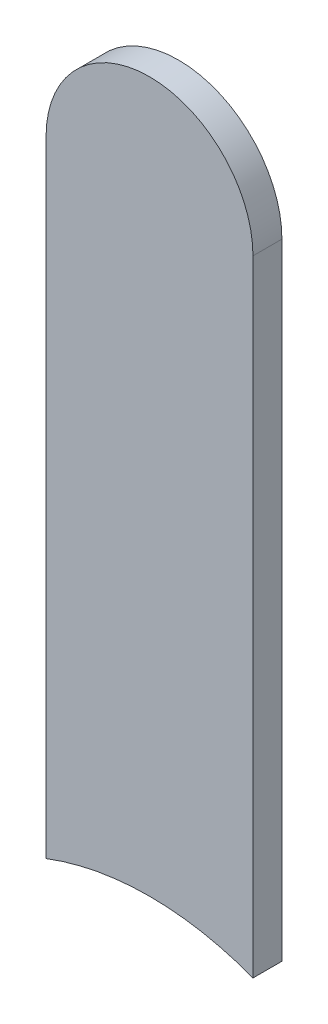
ISO-10303-21;
HEADER;
FILE_DESCRIPTION(('STEP AP214'),'2;1');
FILE_NAME('part.step','',(''),(''),'','','');
FILE_SCHEMA(('AUTOMOTIVE_DESIGN { 1 0 10303 214 1 1 1 1 }'));
ENDSEC;
DATA;
#1=APPLICATION_CONTEXT('core data for automotive mechanical design processes');
#2=APPLICATION_PROTOCOL_DEFINITION('international standard','automotive_design',2000,#1);
#3=PRODUCT_CONTEXT('',#1,'mechanical');
#4=PRODUCT('Part','Part','',(#3));
#5=PRODUCT_RELATED_PRODUCT_CATEGORY('part','',(#4));
#6=PRODUCT_DEFINITION_FORMATION('','',#4);
#7=PRODUCT_DEFINITION_CONTEXT('part definition',#1,'design');
#8=PRODUCT_DEFINITION('design','',#6,#7);
#9=PRODUCT_DEFINITION_SHAPE('','',#8);
#10=(LENGTH_UNIT() NAMED_UNIT(*) SI_UNIT(.MILLI.,.METRE.));
#11=(NAMED_UNIT(*) PLANE_ANGLE_UNIT() SI_UNIT($,.RADIAN.));
#12=(NAMED_UNIT(*) SI_UNIT($,.STERADIAN.) SOLID_ANGLE_UNIT());
#13=UNCERTAINTY_MEASURE_WITH_UNIT(LENGTH_MEASURE(1.E-05),#10,'distance_accuracy_value','');
#14=(GEOMETRIC_REPRESENTATION_CONTEXT(3) GLOBAL_UNCERTAINTY_ASSIGNED_CONTEXT((#13)) GLOBAL_UNIT_ASSIGNED_CONTEXT((#10,
#11,#12)) REPRESENTATION_CONTEXT('',''));
#15=CARTESIAN_POINT('',(0.,0.,0.));
#16=DIRECTION('',(0.,0.,1.));
#17=DIRECTION('',(1.,0.,0.));
#18=AXIS2_PLACEMENT_3D('',#15,#16,#17);
#19=CARTESIAN_POINT('',(92.8439723,93.0191204594978,0.));
#20=DIRECTION('',(-1.,0.,0.));
#21=DIRECTION('',(0.,1.,0.));
#22=AXIS2_PLACEMENT_3D('',#19,#20,#21);
#23=PLANE('',#22);
#24=DIRECTION('',(0.,1.,0.));
#25=VECTOR('',#24,1.);
#26=CARTESIAN_POINT('',(92.8439723,92.68697236,0.03556));
#27=LINE('',#26,#25);
#28=CARTESIAN_POINT('',(92.8439723,93.0191204594978,0.03556));
#29=VERTEX_POINT('',#28);
#30=CARTESIAN_POINT('',(92.8439723,93.7869727,0.03556));
#31=VERTEX_POINT('',#30);
#32=EDGE_CURVE('E11',#29,#31,#27,.T.);
#33=ORIENTED_EDGE('',*,*,#32,.F.);
#34=DIRECTION('',(0.,0.,1.));
#35=VECTOR('',#34,1.);
#36=CARTESIAN_POINT('',(92.8439723,93.0191204594978,0.));
#37=LINE('',#36,#35);
#38=CARTESIAN_POINT('',(92.8439723,93.0191204594978,0.));
#39=VERTEX_POINT('',#38);
#40=EDGE_CURVE('E24',#39,#29,#37,.T.);
#41=ORIENTED_EDGE('',*,*,#40,.F.);
#42=DIRECTION('',(0.,1.,0.));
#43=VECTOR('',#42,1.);
#44=CARTESIAN_POINT('',(92.8439723,92.68697236,0.));
#45=LINE('',#44,#43);
#46=CARTESIAN_POINT('',(92.8439723,93.7869727,0.));
#47=VERTEX_POINT('',#46);
#48=EDGE_CURVE('E75',#39,#47,#45,.T.);
#49=ORIENTED_EDGE('',*,*,#48,.T.);
#50=DIRECTION('',(0.,0.,1.));
#51=VECTOR('',#50,1.);
#52=CARTESIAN_POINT('',(92.8439723,93.7869727,0.));
#53=LINE('',#52,#51);
#54=EDGE_CURVE('E37',#47,#31,#53,.T.);
#55=ORIENTED_EDGE('',*,*,#54,.T.);
#56=EDGE_LOOP('',(#33,#41,#49,#55));
#57=FACE_BOUND('',#56,.T.);
#58=ADVANCED_FACE('F17',(#57),#23,.F.);
#59=CARTESIAN_POINT('',(92.7169723,93.7869727,0.));
#60=DIRECTION('',(0.,0.,-1.));
#61=DIRECTION('',(1.,-1.11896493820492E-13,0.));
#62=AXIS2_PLACEMENT_3D('',#59,#60,#61);
#63=CYLINDRICAL_SURFACE('',#62,0.127);
#64=CARTESIAN_POINT('',(92.7169723,93.7869727,0.03556));
#65=DIRECTION('',(0.,0.,1.));
#66=DIRECTION('',(1.,-1.11896493820492E-13,0.));
#67=AXIS2_PLACEMENT_3D('',#64,#65,#66);
#68=CIRCLE('',#67,0.127);
#69=CARTESIAN_POINT('',(92.5899723,93.7869727,0.03556));
#70=VERTEX_POINT('',#69);
#71=EDGE_CURVE('E83',#31,#70,#68,.T.);
#72=ORIENTED_EDGE('',*,*,#71,.F.);
#73=ORIENTED_EDGE('',*,*,#54,.F.);
#74=CARTESIAN_POINT('',(92.7169723,93.7869727,0.));
#75=DIRECTION('',(0.,0.,1.));
#76=DIRECTION('',(1.,-1.11896493820492E-13,0.));
#77=AXIS2_PLACEMENT_3D('',#74,#75,#76);
#78=CIRCLE('',#77,0.127);
#79=CARTESIAN_POINT('',(92.5899723,93.7869727,0.));
#80=VERTEX_POINT('',#79);
#81=EDGE_CURVE('E81',#47,#80,#78,.T.);
#82=ORIENTED_EDGE('',*,*,#81,.T.);
#83=DIRECTION('',(0.,0.,1.));
#84=VECTOR('',#83,1.);
#85=CARTESIAN_POINT('',(92.5899723,93.7869727,0.));
#86=LINE('',#85,#84);
#87=EDGE_CURVE('E67',#80,#70,#86,.T.);
#88=ORIENTED_EDGE('',*,*,#87,.T.);
#89=EDGE_LOOP('',(#72,#73,#82,#88));
#90=FACE_BOUND('',#89,.T.);
#91=ADVANCED_FACE('F89',(#90),#63,.T.);
#92=CARTESIAN_POINT('',(92.5899723,93.7869727,0.));
#93=DIRECTION('',(1.,0.,0.));
#94=DIRECTION('',(0.,-1.,0.));
#95=AXIS2_PLACEMENT_3D('',#92,#93,#94);
#96=PLANE('',#95);
#97=DIRECTION('',(0.,-1.,0.));
#98=VECTOR('',#97,1.);
#99=CARTESIAN_POINT('',(92.5899723,93.7869727,0.03556));
#100=LINE('',#99,#98);
#101=CARTESIAN_POINT('',(92.5899723,93.0191204594978,0.03556));
#102=VERTEX_POINT('',#101);
#103=EDGE_CURVE('E71',#70,#102,#100,.T.);
#104=ORIENTED_EDGE('',*,*,#103,.F.);
#105=ORIENTED_EDGE('',*,*,#87,.F.);
#106=DIRECTION('',(0.,-1.,0.));
#107=VECTOR('',#106,1.);
#108=CARTESIAN_POINT('',(92.5899723,93.7869727,0.));
#109=LINE('',#108,#107);
#110=CARTESIAN_POINT('',(92.5899723,93.0191204594978,0.));
#111=VERTEX_POINT('',#110);
#112=EDGE_CURVE('E63',#80,#111,#109,.T.);
#113=ORIENTED_EDGE('',*,*,#112,.T.);
#114=DIRECTION('',(0.,0.,1.));
#115=VECTOR('',#114,1.);
#116=CARTESIAN_POINT('',(92.5899723,93.0191204594978,0.));
#117=LINE('',#116,#115);
#118=EDGE_CURVE('E53',#111,#102,#117,.T.);
#119=ORIENTED_EDGE('',*,*,#118,.T.);
#120=EDGE_LOOP('',(#104,#105,#113,#119));
#121=FACE_BOUND('',#120,.T.);
#122=ADVANCED_FACE('F66',(#121),#96,.F.);
#123=CARTESIAN_POINT('',(92.7169723,92.68697236,0.));
#124=DIRECTION('',(0.,0.,-1.));
#125=DIRECTION('',(1.,0.,0.));
#126=AXIS2_PLACEMENT_3D('',#123,#124,#125);
#127=CYLINDRICAL_SURFACE('',#126,0.3556);
#128=ORIENTED_EDGE('',*,*,#40,.T.);
#129=CARTESIAN_POINT('',(92.7169723,92.68697236,0.03556));
#130=DIRECTION('',(0.,0.,1.));
#131=DIRECTION('',(1.,0.,0.));
#132=AXIS2_PLACEMENT_3D('',#129,#130,#131);
#133=CIRCLE('',#132,0.3556);
#134=EDGE_CURVE('E59',#29,#102,#133,.T.);
#135=ORIENTED_EDGE('',*,*,#134,.T.);
#136=ORIENTED_EDGE('',*,*,#118,.F.);
#137=CARTESIAN_POINT('',(92.7169723,92.68697236,0.));
#138=DIRECTION('',(0.,0.,1.));
#139=DIRECTION('',(1.,0.,0.));
#140=AXIS2_PLACEMENT_3D('',#137,#138,#139);
#141=CIRCLE('',#140,0.3556);
#142=EDGE_CURVE('E57',#39,#111,#141,.T.);
#143=ORIENTED_EDGE('',*,*,#142,.F.);
#144=EDGE_LOOP('',(#128,#135,#136,#143));
#145=FACE_BOUND('',#144,.T.);
#146=ADVANCED_FACE('F55',(#145),#127,.F.);
#147=CARTESIAN_POINT('',(92.8439723,92.68697236,0.));
#148=DIRECTION('',(0.,0.,-1.));
#149=DIRECTION('',(-1.,0.,0.));
#150=AXIS2_PLACEMENT_3D('',#147,#148,#149);
#151=PLANE('',#150);
#152=ORIENTED_EDGE('',*,*,#48,.F.);
#153=ORIENTED_EDGE('',*,*,#142,.T.);
#154=ORIENTED_EDGE('',*,*,#112,.F.);
#155=ORIENTED_EDGE('',*,*,#81,.F.);
#156=EDGE_LOOP('',(#152,#153,#154,#155));
#157=FACE_BOUND('',#156,.T.);
#158=ADVANCED_FACE('F74',(#157),#151,.T.);
#159=CARTESIAN_POINT('',(92.8439723,92.68697236,0.03556));
#160=DIRECTION('',(0.,0.,-1.));
#161=DIRECTION('',(-1.,0.,0.));
#162=AXIS2_PLACEMENT_3D('',#159,#160,#161);
#163=PLANE('',#162);
#164=ORIENTED_EDGE('',*,*,#134,.F.);
#165=ORIENTED_EDGE('',*,*,#32,.T.);
#166=ORIENTED_EDGE('',*,*,#71,.T.);
#167=ORIENTED_EDGE('',*,*,#103,.T.);
#168=EDGE_LOOP('',(#164,#165,#166,#167));
#169=FACE_BOUND('',#168,.T.);
#170=ADVANCED_FACE('F91',(#169),#163,.F.);
#171=CLOSED_SHELL('',(#58,#91,#122,#146,#158,#170));
#172=MANIFOLD_SOLID_BREP('B1',#171);
#173=ADVANCED_BREP_SHAPE_REPRESENTATION('',(#18,#172),#14);
#174=SHAPE_DEFINITION_REPRESENTATION(#9,#173);
ENDSEC;
END-ISO-10303-21;
